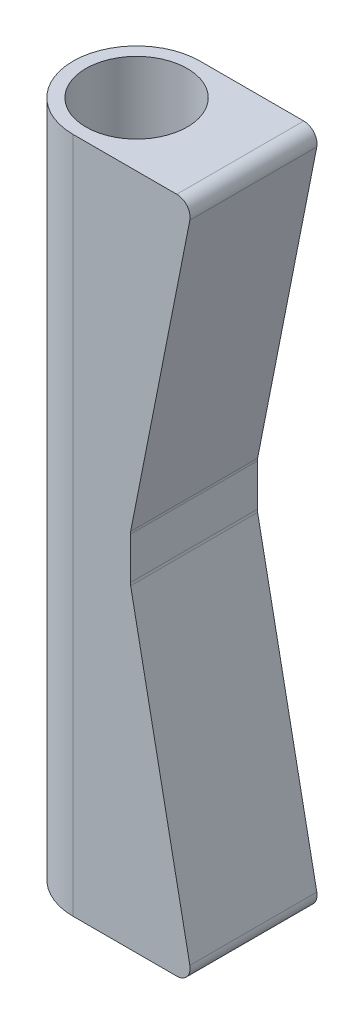
ISO-10303-21;
HEADER;
FILE_DESCRIPTION(('STEP AP214'),'2;1');
FILE_NAME('part.step','',(''),(''),'','','');
FILE_SCHEMA(('AUTOMOTIVE_DESIGN { 1 0 10303 214 1 1 1 1 }'));
ENDSEC;
DATA;
#1=APPLICATION_CONTEXT('core data for automotive mechanical design processes');
#2=APPLICATION_PROTOCOL_DEFINITION('international standard','automotive_design',2000,#1);
#3=PRODUCT_CONTEXT('',#1,'mechanical');
#4=PRODUCT('Part','Part','',(#3));
#5=PRODUCT_RELATED_PRODUCT_CATEGORY('part','',(#4));
#6=PRODUCT_DEFINITION_FORMATION('','',#4);
#7=PRODUCT_DEFINITION_CONTEXT('part definition',#1,'design');
#8=PRODUCT_DEFINITION('design','',#6,#7);
#9=PRODUCT_DEFINITION_SHAPE('','',#8);
#10=(LENGTH_UNIT() NAMED_UNIT(*) SI_UNIT(.MILLI.,.METRE.));
#11=(NAMED_UNIT(*) PLANE_ANGLE_UNIT() SI_UNIT($,.RADIAN.));
#12=(NAMED_UNIT(*) SI_UNIT($,.STERADIAN.) SOLID_ANGLE_UNIT());
#13=UNCERTAINTY_MEASURE_WITH_UNIT(LENGTH_MEASURE(1.E-05),#10,'distance_accuracy_value','');
#14=(GEOMETRIC_REPRESENTATION_CONTEXT(3) GLOBAL_UNCERTAINTY_ASSIGNED_CONTEXT((#13)) GLOBAL_UNIT_ASSIGNED_CONTEXT((#10,
#11,#12)) REPRESENTATION_CONTEXT('',''));
#15=CARTESIAN_POINT('',(0.,0.,0.));
#16=DIRECTION('',(0.,0.,1.));
#17=DIRECTION('',(1.,0.,0.));
#18=AXIS2_PLACEMENT_3D('',#15,#16,#17);
#19=CARTESIAN_POINT('',(0.,152.4,0.));
#20=DIRECTION('',(0.,-1.,0.));
#21=DIRECTION('',(0.,0.,-1.));
#22=AXIS2_PLACEMENT_3D('',#19,#20,#21);
#23=CYLINDRICAL_SURFACE('',#22,14.2875);
#24=DIRECTION('',(0.,1.,0.));
#25=VECTOR('',#24,1.);
#26=CARTESIAN_POINT('',(0.,0.,14.2875));
#27=LINE('',#26,#25);
#28=CARTESIAN_POINT('',(0.,0.,14.2875));
#29=VERTEX_POINT('',#28);
#30=CARTESIAN_POINT('',(0.,152.4,14.2875));
#31=VERTEX_POINT('',#30);
#32=EDGE_CURVE('E137',#29,#31,#27,.T.);
#33=ORIENTED_EDGE('',*,*,#32,.T.);
#34=CARTESIAN_POINT('',(0.,152.4,0.));
#35=DIRECTION('',(0.,1.,0.));
#36=DIRECTION('',(0.,0.,1.));
#37=AXIS2_PLACEMENT_3D('',#34,#35,#36);
#38=CIRCLE('',#37,14.2875);
#39=CARTESIAN_POINT('',(0.,152.4,-14.2875));
#40=VERTEX_POINT('',#39);
#41=EDGE_CURVE('E135',#40,#31,#38,.T.);
#42=ORIENTED_EDGE('',*,*,#41,.F.);
#43=DIRECTION('',(0.,1.,0.));
#44=VECTOR('',#43,1.);
#45=CARTESIAN_POINT('',(0.,0.,-14.2875));
#46=LINE('',#45,#44);
#47=CARTESIAN_POINT('',(0.,0.,-14.2875));
#48=VERTEX_POINT('',#47);
#49=EDGE_CURVE('E121',#48,#40,#46,.T.);
#50=ORIENTED_EDGE('',*,*,#49,.F.);
#51=CARTESIAN_POINT('',(0.,0.,0.));
#52=DIRECTION('',(0.,1.,0.));
#53=DIRECTION('',(0.,0.,1.));
#54=AXIS2_PLACEMENT_3D('',#51,#52,#53);
#55=CIRCLE('',#54,14.2875);
#56=EDGE_CURVE('E133',#48,#29,#55,.T.);
#57=ORIENTED_EDGE('',*,*,#56,.T.);
#58=EDGE_LOOP('',(#33,#42,#50,#57));
#59=FACE_BOUND('',#58,.T.);
#60=ADVANCED_FACE('F39',(#59),#23,.T.);
#61=CARTESIAN_POINT('',(0.,152.4,0.));
#62=DIRECTION('',(0.,1.,0.));
#63=DIRECTION('',(0.,0.,1.));
#64=AXIS2_PLACEMENT_3D('',#61,#62,#63);
#65=PLANE('',#64);
#66=DIRECTION('',(1.,0.,0.));
#67=VECTOR('',#66,1.);
#68=CARTESIAN_POINT('',(14.2875,152.4,14.2875));
#69=LINE('',#68,#67);
#70=CARTESIAN_POINT('',(23.3356277952367,152.4,14.2875));
#71=VERTEX_POINT('',#70);
#72=EDGE_CURVE('E128',#31,#71,#69,.T.);
#73=ORIENTED_EDGE('',*,*,#72,.T.);
#74=DIRECTION('',(0.,0.,-1.));
#75=VECTOR('',#74,1.);
#76=CARTESIAN_POINT('',(23.3356277952367,152.4,-14.2875));
#77=LINE('',#76,#75);
#78=CARTESIAN_POINT('',(23.3356277952367,152.4,-14.2875));
#79=VERTEX_POINT('',#78);
#80=EDGE_CURVE('E146',#71,#79,#77,.T.);
#81=ORIENTED_EDGE('',*,*,#80,.T.);
#82=DIRECTION('',(-1.,0.,0.));
#83=VECTOR('',#82,1.);
#84=CARTESIAN_POINT('',(14.2875,152.4,-14.2875));
#85=LINE('',#84,#83);
#86=EDGE_CURVE('E235',#79,#40,#85,.T.);
#87=ORIENTED_EDGE('',*,*,#86,.T.);
#88=ORIENTED_EDGE('',*,*,#41,.T.);
#89=EDGE_LOOP('',(#73,#81,#87,#88));
#90=FACE_BOUND('',#89,.T.);
#91=CARTESIAN_POINT('',(0.,152.4,0.));
#92=DIRECTION('',(0.,1.,0.));
#93=DIRECTION('',(0.,0.,1.));
#94=AXIS2_PLACEMENT_3D('',#91,#92,#93);
#95=CIRCLE('',#94,11.4125);
#96=CARTESIAN_POINT('',(0.,152.4,11.4125));
#97=VERTEX_POINT('',#96);
#98=EDGE_CURVE('E142',#97,#97,#95,.T.);
#99=ORIENTED_EDGE('',*,*,#98,.F.);
#100=EDGE_LOOP('',(#99));
#101=FACE_BOUND('',#100,.T.);
#102=ADVANCED_FACE('F255',(#90,#101),#65,.T.);
#103=CARTESIAN_POINT('',(0.,0.,0.));
#104=DIRECTION('',(0.,1.,0.));
#105=DIRECTION('',(0.,0.,1.));
#106=AXIS2_PLACEMENT_3D('',#103,#104,#105);
#107=PLANE('',#106);
#108=DIRECTION('',(-1.,0.,0.));
#109=VECTOR('',#108,1.);
#110=CARTESIAN_POINT('',(26.9875,0.,-14.2875));
#111=LINE('',#110,#109);
#112=CARTESIAN_POINT('',(23.3356277952367,0.,-14.2875));
#113=VERTEX_POINT('',#112);
#114=EDGE_CURVE('E117',#113,#48,#111,.T.);
#115=ORIENTED_EDGE('',*,*,#114,.F.);
#116=DIRECTION('',(0.,0.,-1.));
#117=VECTOR('',#116,1.);
#118=CARTESIAN_POINT('',(23.3356277952367,0.,0.));
#119=LINE('',#118,#117);
#120=CARTESIAN_POINT('',(23.3356277952367,0.,14.2875));
#121=VERTEX_POINT('',#120);
#122=EDGE_CURVE('E55',#113,#121,#119,.F.);
#123=ORIENTED_EDGE('',*,*,#122,.T.);
#124=DIRECTION('',(1.,0.,0.));
#125=VECTOR('',#124,1.);
#126=CARTESIAN_POINT('',(14.2875,0.,14.2875));
#127=LINE('',#126,#125);
#128=EDGE_CURVE('E127',#29,#121,#127,.T.);
#129=ORIENTED_EDGE('',*,*,#128,.F.);
#130=ORIENTED_EDGE('',*,*,#56,.F.);
#131=EDGE_LOOP('',(#115,#123,#129,#130));
#132=FACE_BOUND('',#131,.T.);
#133=CARTESIAN_POINT('',(0.,0.,0.));
#134=DIRECTION('',(0.,1.,0.));
#135=DIRECTION('',(0.,0.,1.));
#136=AXIS2_PLACEMENT_3D('',#133,#134,#135);
#137=CIRCLE('',#136,11.4125);
#138=CARTESIAN_POINT('',(0.,0.,11.4125));
#139=VERTEX_POINT('',#138);
#140=EDGE_CURVE('E149',#139,#139,#137,.T.);
#141=ORIENTED_EDGE('',*,*,#140,.T.);
#142=EDGE_LOOP('',(#141));
#143=FACE_BOUND('',#142,.T.);
#144=ADVANCED_FACE('F139',(#132,#143),#107,.F.);
#145=CARTESIAN_POINT('',(0.,152.4,0.));
#146=DIRECTION('',(0.,-1.,0.));
#147=DIRECTION('',(0.,0.,-1.));
#148=AXIS2_PLACEMENT_3D('',#145,#146,#147);
#149=CYLINDRICAL_SURFACE('',#148,11.4125);
#150=ORIENTED_EDGE('',*,*,#98,.T.);
#151=EDGE_LOOP('',(#150));
#152=FACE_BOUND('',#151,.T.);
#153=ORIENTED_EDGE('',*,*,#140,.F.);
#154=EDGE_LOOP('',(#153));
#155=FACE_BOUND('',#154,.T.);
#156=ADVANCED_FACE('F246',(#152,#155),#149,.F.);
#157=CARTESIAN_POINT('',(14.2875,0.,14.2875));
#158=DIRECTION('',(0.,0.,1.));
#159=DIRECTION('',(1.,0.,0.));
#160=AXIS2_PLACEMENT_3D('',#157,#158,#159);
#161=PLANE('',#160);
#162=DIRECTION('',(-0.194132229628374,-0.980975370444904,0.));
#163=VECTOR('',#162,1.);
#164=CARTESIAN_POINT('',(12.8972229492404,81.2,14.2875));
#165=LINE('',#164,#163);
#166=CARTESIAN_POINT('',(26.2785539065714,148.817603311115,14.2875));
#167=VERTEX_POINT('',#166);
#168=CARTESIAN_POINT('',(12.9542968379057,81.4884017722526,14.2875));
#169=VERTEX_POINT('',#168);
#170=EDGE_CURVE('E217',#167,#169,#165,.T.);
#171=ORIENTED_EDGE('',*,*,#170,.F.);
#172=CARTESIAN_POINT('',(23.3356277952367,149.4,14.2875));
#173=DIRECTION('',(0.,0.,1.));
#174=DIRECTION('',(1.,0.,0.));
#175=AXIS2_PLACEMENT_3D('',#172,#173,#174);
#176=CIRCLE('',#175,3.);
#177=EDGE_CURVE('E170',#167,#71,#176,.T.);
#178=ORIENTED_EDGE('',*,*,#177,.T.);
#179=ORIENTED_EDGE('',*,*,#72,.F.);
#180=ORIENTED_EDGE('',*,*,#32,.F.);
#181=ORIENTED_EDGE('',*,*,#128,.T.);
#182=CARTESIAN_POINT('',(23.3356277952367,3.,14.2875));
#183=DIRECTION('',(0.,0.,1.));
#184=DIRECTION('',(1.,0.,0.));
#185=AXIS2_PLACEMENT_3D('',#182,#183,#184);
#186=CIRCLE('',#185,3.);
#187=CARTESIAN_POINT('',(26.2785539065714,3.58239668888512,14.2875));
#188=VERTEX_POINT('',#187);
#189=EDGE_CURVE('E167',#121,#188,#186,.T.);
#190=ORIENTED_EDGE('',*,*,#189,.T.);
#191=DIRECTION('',(0.194132229628374,-0.980975370444904,0.));
#192=VECTOR('',#191,1.);
#193=CARTESIAN_POINT('',(26.9875,0.,14.2875));
#194=LINE('',#193,#192);
#195=CARTESIAN_POINT('',(12.9542968379057,70.9115982277474,14.2875));
#196=VERTEX_POINT('',#195);
#197=EDGE_CURVE('E226',#196,#188,#194,.T.);
#198=ORIENTED_EDGE('',*,*,#197,.F.);
#199=CARTESIAN_POINT('',(15.8972229492404,71.4939949166326,14.2875));
#200=DIRECTION('',(0.,0.,1.));
#201=DIRECTION('',(1.,0.,0.));
#202=AXIS2_PLACEMENT_3D('',#199,#200,#201);
#203=CIRCLE('',#202,3.);
#204=CARTESIAN_POINT('',(12.8972229492404,71.4939949166326,14.2875));
#205=VERTEX_POINT('',#204);
#206=EDGE_CURVE('E48',#196,#205,#203,.F.);
#207=ORIENTED_EDGE('',*,*,#206,.T.);
#208=DIRECTION('',(0.,-1.,0.));
#209=VECTOR('',#208,1.);
#210=CARTESIAN_POINT('',(12.8972229492404,71.2,14.2875));
#211=LINE('',#210,#209);
#212=CARTESIAN_POINT('',(12.8972229492404,80.9060050833674,14.2875));
#213=VERTEX_POINT('',#212);
#214=EDGE_CURVE('E219',#213,#205,#211,.T.);
#215=ORIENTED_EDGE('',*,*,#214,.F.);
#216=CARTESIAN_POINT('',(15.8972229492404,80.9060050833674,14.2875));
#217=DIRECTION('',(0.,0.,1.));
#218=DIRECTION('',(1.,0.,0.));
#219=AXIS2_PLACEMENT_3D('',#216,#217,#218);
#220=CIRCLE('',#219,3.);
#221=EDGE_CURVE('E190',#213,#169,#220,.F.);
#222=ORIENTED_EDGE('',*,*,#221,.T.);
#223=EDGE_LOOP('',(#171,#178,#179,#180,#181,#190,#198,#207,#215,#222));
#224=FACE_BOUND('',#223,.T.);
#225=ADVANCED_FACE('F216',(#224),#161,.T.);
#226=CARTESIAN_POINT('',(14.2875,0.,-14.2875));
#227=DIRECTION('',(0.,0.,-1.));
#228=DIRECTION('',(-1.,0.,0.));
#229=AXIS2_PLACEMENT_3D('',#226,#227,#228);
#230=PLANE('',#229);
#231=ORIENTED_EDGE('',*,*,#86,.F.);
#232=CARTESIAN_POINT('',(23.3356277952367,149.4,-14.2875));
#233=DIRECTION('',(0.,0.,-1.));
#234=DIRECTION('',(-1.,0.,0.));
#235=AXIS2_PLACEMENT_3D('',#232,#233,#234);
#236=CIRCLE('',#235,3.);
#237=CARTESIAN_POINT('',(26.2785539065714,148.817603311115,-14.2875));
#238=VERTEX_POINT('',#237);
#239=EDGE_CURVE('E158',#79,#238,#236,.T.);
#240=ORIENTED_EDGE('',*,*,#239,.T.);
#241=DIRECTION('',(-0.194132229628374,-0.980975370444904,0.));
#242=VECTOR('',#241,1.);
#243=CARTESIAN_POINT('',(12.8972229492404,81.2,-14.2875));
#244=LINE('',#243,#242);
#245=CARTESIAN_POINT('',(12.9542968379057,81.4884017722526,-14.2875));
#246=VERTEX_POINT('',#245);
#247=EDGE_CURVE('E203',#238,#246,#244,.T.);
#248=ORIENTED_EDGE('',*,*,#247,.T.);
#249=CARTESIAN_POINT('',(15.8972229492404,80.9060050833674,-14.2875));
#250=DIRECTION('',(0.,0.,-1.));
#251=DIRECTION('',(-1.,0.,0.));
#252=AXIS2_PLACEMENT_3D('',#249,#250,#251);
#253=CIRCLE('',#252,3.);
#254=CARTESIAN_POINT('',(12.8972229492404,80.9060050833674,-14.2875));
#255=VERTEX_POINT('',#254);
#256=EDGE_CURVE('E193',#246,#255,#253,.F.);
#257=ORIENTED_EDGE('',*,*,#256,.T.);
#258=DIRECTION('',(0.,-1.,0.));
#259=VECTOR('',#258,1.);
#260=CARTESIAN_POINT('',(12.8972229492404,71.2,-14.2875));
#261=LINE('',#260,#259);
#262=CARTESIAN_POINT('',(12.8972229492404,71.4939949166326,-14.2875));
#263=VERTEX_POINT('',#262);
#264=EDGE_CURVE('E200',#255,#263,#261,.T.);
#265=ORIENTED_EDGE('',*,*,#264,.T.);
#266=CARTESIAN_POINT('',(15.8972229492404,71.4939949166326,-14.2875));
#267=DIRECTION('',(0.,0.,-1.));
#268=DIRECTION('',(-1.,0.,0.));
#269=AXIS2_PLACEMENT_3D('',#266,#267,#268);
#270=CIRCLE('',#269,3.);
#271=CARTESIAN_POINT('',(12.9542968379057,70.9115982277474,-14.2875));
#272=VERTEX_POINT('',#271);
#273=EDGE_CURVE('E11',#263,#272,#270,.F.);
#274=ORIENTED_EDGE('',*,*,#273,.T.);
#275=DIRECTION('',(0.194132229628374,-0.980975370444904,0.));
#276=VECTOR('',#275,1.);
#277=CARTESIAN_POINT('',(26.9875,0.,-14.2875));
#278=LINE('',#277,#276);
#279=CARTESIAN_POINT('',(26.2785539065714,3.58239668888512,-14.2875));
#280=VERTEX_POINT('',#279);
#281=EDGE_CURVE('E211',#272,#280,#278,.T.);
#282=ORIENTED_EDGE('',*,*,#281,.T.);
#283=CARTESIAN_POINT('',(23.3356277952367,3.,-14.2875));
#284=DIRECTION('',(0.,0.,-1.));
#285=DIRECTION('',(-1.,0.,0.));
#286=AXIS2_PLACEMENT_3D('',#283,#284,#285);
#287=CIRCLE('',#286,3.);
#288=EDGE_CURVE('E124',#280,#113,#287,.T.);
#289=ORIENTED_EDGE('',*,*,#288,.T.);
#290=ORIENTED_EDGE('',*,*,#114,.T.);
#291=ORIENTED_EDGE('',*,*,#49,.T.);
#292=EDGE_LOOP('',(#231,#240,#248,#257,#265,#274,#282,#289,#290,#291));
#293=FACE_BOUND('',#292,.T.);
#294=ADVANCED_FACE('F120',(#293),#230,.T.);
#295=CARTESIAN_POINT('',(26.9875,0.,-14.2875));
#296=DIRECTION('',(-0.980975370444904,-0.194132229628374,0.));
#297=DIRECTION('',(0.194132229628374,-0.980975370444904,0.));
#298=AXIS2_PLACEMENT_3D('',#295,#296,#297);
#299=PLANE('',#298);
#300=ORIENTED_EDGE('',*,*,#281,.F.);
#301=DIRECTION('',(0.,0.,1.));
#302=VECTOR('',#301,1.);
#303=CARTESIAN_POINT('',(12.9542968379057,70.9115982277474,14.2875));
#304=LINE('',#303,#302);
#305=EDGE_CURVE('E184',#272,#196,#304,.T.);
#306=ORIENTED_EDGE('',*,*,#305,.T.);
#307=ORIENTED_EDGE('',*,*,#197,.T.);
#308=DIRECTION('',(0.,0.,-1.));
#309=VECTOR('',#308,1.);
#310=CARTESIAN_POINT('',(26.2785539065714,3.58239668888512,-14.2875));
#311=LINE('',#310,#309);
#312=EDGE_CURVE('E180',#188,#280,#311,.T.);
#313=ORIENTED_EDGE('',*,*,#312,.T.);
#314=EDGE_LOOP('',(#300,#306,#307,#313));
#315=FACE_BOUND('',#314,.T.);
#316=ADVANCED_FACE('F281',(#315),#299,.F.);
#317=CARTESIAN_POINT('',(12.8972229492404,71.2,-14.2875));
#318=DIRECTION('',(-1.,0.,0.));
#319=DIRECTION('',(0.,0.,1.));
#320=AXIS2_PLACEMENT_3D('',#317,#318,#319);
#321=PLANE('',#320);
#322=ORIENTED_EDGE('',*,*,#264,.F.);
#323=DIRECTION('',(0.,0.,1.));
#324=VECTOR('',#323,1.);
#325=CARTESIAN_POINT('',(12.8972229492404,80.9060050833674,14.2875));
#326=LINE('',#325,#324);
#327=EDGE_CURVE('E176',#255,#213,#326,.T.);
#328=ORIENTED_EDGE('',*,*,#327,.T.);
#329=ORIENTED_EDGE('',*,*,#214,.T.);
#330=DIRECTION('',(0.,0.,1.));
#331=VECTOR('',#330,1.);
#332=CARTESIAN_POINT('',(12.8972229492404,71.4939949166326,-14.2875));
#333=LINE('',#332,#331);
#334=EDGE_CURVE('E173',#205,#263,#333,.F.);
#335=ORIENTED_EDGE('',*,*,#334,.T.);
#336=EDGE_LOOP('',(#322,#328,#329,#335));
#337=FACE_BOUND('',#336,.T.);
#338=ADVANCED_FACE('F208',(#337),#321,.F.);
#339=CARTESIAN_POINT('',(12.8972229492404,81.2,-14.2875));
#340=DIRECTION('',(-0.980975370444904,0.194132229628374,0.));
#341=DIRECTION('',(-0.194132229628374,-0.980975370444904,0.));
#342=AXIS2_PLACEMENT_3D('',#339,#340,#341);
#343=PLANE('',#342);
#344=ORIENTED_EDGE('',*,*,#247,.F.);
#345=DIRECTION('',(0.,0.,-1.));
#346=VECTOR('',#345,1.);
#347=CARTESIAN_POINT('',(26.2785539065714,148.817603311115,14.2875));
#348=LINE('',#347,#346);
#349=EDGE_CURVE('E164',#238,#167,#348,.F.);
#350=ORIENTED_EDGE('',*,*,#349,.T.);
#351=ORIENTED_EDGE('',*,*,#170,.T.);
#352=DIRECTION('',(0.,0.,1.));
#353=VECTOR('',#352,1.);
#354=CARTESIAN_POINT('',(12.9542968379057,81.4884017722526,-14.2875));
#355=LINE('',#354,#353);
#356=EDGE_CURVE('E161',#169,#246,#355,.F.);
#357=ORIENTED_EDGE('',*,*,#356,.T.);
#358=EDGE_LOOP('',(#344,#350,#351,#357));
#359=FACE_BOUND('',#358,.T.);
#360=ADVANCED_FACE('F221',(#359),#343,.F.);
#361=CARTESIAN_POINT('',(23.3356277952367,149.4,0.));
#362=DIRECTION('',(0.,0.,1.));
#363=DIRECTION('',(1.,0.,0.));
#364=AXIS2_PLACEMENT_3D('',#361,#362,#363);
#365=CYLINDRICAL_SURFACE('',#364,3.);
#366=ORIENTED_EDGE('',*,*,#177,.F.);
#367=ORIENTED_EDGE('',*,*,#349,.F.);
#368=ORIENTED_EDGE('',*,*,#239,.F.);
#369=ORIENTED_EDGE('',*,*,#80,.F.);
#370=EDGE_LOOP('',(#366,#367,#368,#369));
#371=FACE_BOUND('',#370,.T.);
#372=ADVANCED_FACE('F266',(#371),#365,.T.);
#373=CARTESIAN_POINT('',(15.8972229492404,80.9060050833674,-14.2875));
#374=DIRECTION('',(0.,0.,-1.));
#375=DIRECTION('',(-1.,0.,0.));
#376=AXIS2_PLACEMENT_3D('',#373,#374,#375);
#377=CYLINDRICAL_SURFACE('',#376,3.);
#378=ORIENTED_EDGE('',*,*,#256,.F.);
#379=ORIENTED_EDGE('',*,*,#356,.F.);
#380=ORIENTED_EDGE('',*,*,#221,.F.);
#381=ORIENTED_EDGE('',*,*,#327,.F.);
#382=EDGE_LOOP('',(#378,#379,#380,#381));
#383=FACE_BOUND('',#382,.T.);
#384=ADVANCED_FACE('F213',(#383),#377,.F.);
#385=CARTESIAN_POINT('',(15.8972229492404,71.4939949166326,-14.2875));
#386=DIRECTION('',(0.,0.,-1.));
#387=DIRECTION('',(-1.,0.,0.));
#388=AXIS2_PLACEMENT_3D('',#385,#386,#387);
#389=CYLINDRICAL_SURFACE('',#388,3.);
#390=ORIENTED_EDGE('',*,*,#273,.F.);
#391=ORIENTED_EDGE('',*,*,#334,.F.);
#392=ORIENTED_EDGE('',*,*,#206,.F.);
#393=ORIENTED_EDGE('',*,*,#305,.F.);
#394=EDGE_LOOP('',(#390,#391,#392,#393));
#395=FACE_BOUND('',#394,.T.);
#396=ADVANCED_FACE('F271',(#395),#389,.F.);
#397=CARTESIAN_POINT('',(23.3356277952367,3.,-14.2875));
#398=DIRECTION('',(0.,0.,-1.));
#399=DIRECTION('',(-1.,0.,0.));
#400=AXIS2_PLACEMENT_3D('',#397,#398,#399);
#401=CYLINDRICAL_SURFACE('',#400,3.);
#402=ORIENTED_EDGE('',*,*,#189,.F.);
#403=ORIENTED_EDGE('',*,*,#122,.F.);
#404=ORIENTED_EDGE('',*,*,#288,.F.);
#405=ORIENTED_EDGE('',*,*,#312,.F.);
#406=EDGE_LOOP('',(#402,#403,#404,#405));
#407=FACE_BOUND('',#406,.T.);
#408=ADVANCED_FACE('F41',(#407),#401,.T.);
#409=CLOSED_SHELL('',(#60,#102,#144,#156,#225,#294,#316,#338,#360,#372,#384,#396,#408));
#410=MANIFOLD_SOLID_BREP('B2',#409);
#411=ADVANCED_BREP_SHAPE_REPRESENTATION('',(#18,#410),#14);
#412=SHAPE_DEFINITION_REPRESENTATION(#9,#411);
ENDSEC;
END-ISO-10303-21;
